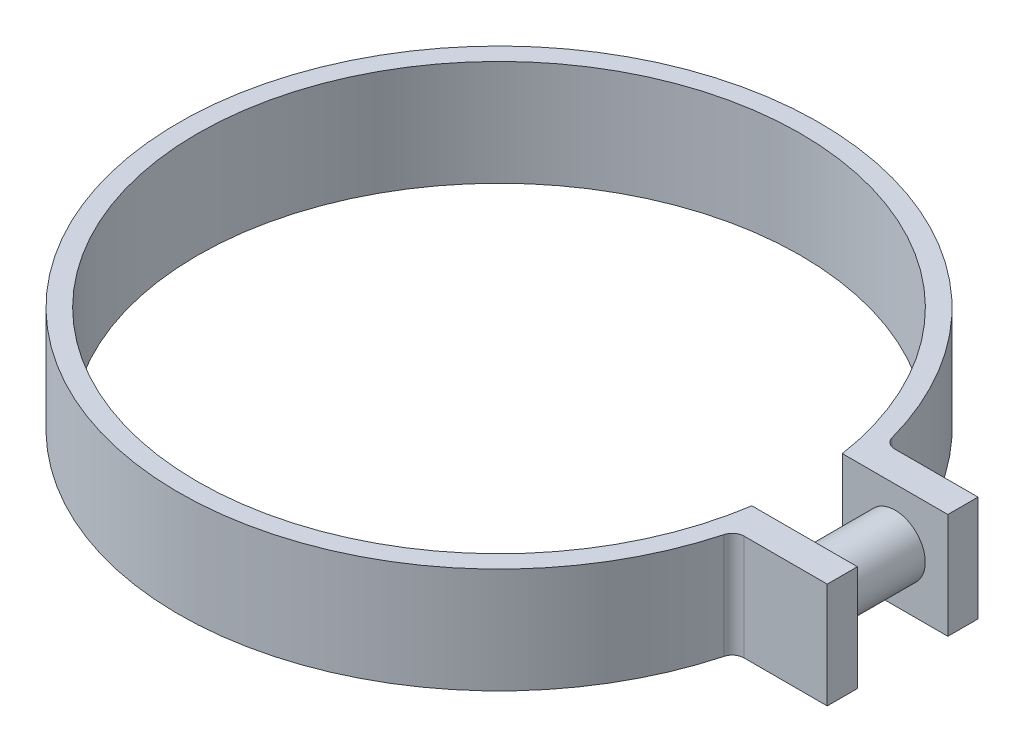
ISO-10303-21;
HEADER;
FILE_DESCRIPTION(('STEP AP214'),'2;1');
FILE_NAME('part.step','',(''),(''),'','','');
FILE_SCHEMA(('AUTOMOTIVE_DESIGN { 1 0 10303 214 1 1 1 1 }'));
ENDSEC;
DATA;
#1=APPLICATION_CONTEXT('core data for automotive mechanical design processes');
#2=APPLICATION_PROTOCOL_DEFINITION('international standard','automotive_design',2000,#1);
#3=PRODUCT_CONTEXT('',#1,'mechanical');
#4=PRODUCT('Part','Part','',(#3));
#5=PRODUCT_RELATED_PRODUCT_CATEGORY('part','',(#4));
#6=PRODUCT_DEFINITION_FORMATION('','',#4);
#7=PRODUCT_DEFINITION_CONTEXT('part definition',#1,'design');
#8=PRODUCT_DEFINITION('design','',#6,#7);
#9=PRODUCT_DEFINITION_SHAPE('','',#8);
#10=(LENGTH_UNIT() NAMED_UNIT(*) SI_UNIT(.MILLI.,.METRE.));
#11=(NAMED_UNIT(*) PLANE_ANGLE_UNIT() SI_UNIT($,.RADIAN.));
#12=(NAMED_UNIT(*) SI_UNIT($,.STERADIAN.) SOLID_ANGLE_UNIT());
#13=UNCERTAINTY_MEASURE_WITH_UNIT(LENGTH_MEASURE(1.E-05),#10,'distance_accuracy_value','');
#14=(GEOMETRIC_REPRESENTATION_CONTEXT(3) GLOBAL_UNCERTAINTY_ASSIGNED_CONTEXT((#13)) GLOBAL_UNIT_ASSIGNED_CONTEXT((#10,
#11,#12)) REPRESENTATION_CONTEXT('',''));
#15=CARTESIAN_POINT('',(0.,0.,0.));
#16=DIRECTION('',(0.,0.,1.));
#17=DIRECTION('',(1.,0.,0.));
#18=AXIS2_PLACEMENT_3D('',#15,#16,#17);
#19=CARTESIAN_POINT('',(34.0026243152722,4.445,-3.81));
#20=DIRECTION('',(-1.,0.,0.));
#21=DIRECTION('',(0.,0.,1.));
#22=AXIS2_PLACEMENT_3D('',#19,#20,#21);
#23=PLANE('',#22);
#24=DIRECTION('',(0.,0.,-1.));
#25=VECTOR('',#24,1.);
#26=CARTESIAN_POINT('',(34.0026243152722,-4.445,-3.81));
#27=LINE('',#26,#25);
#28=CARTESIAN_POINT('',(34.0026243152722,-4.445,-3.81));
#29=VERTEX_POINT('',#28);
#30=CARTESIAN_POINT('',(34.0026243152722,-4.445,-6.35));
#31=VERTEX_POINT('',#30);
#32=EDGE_CURVE('E159',#29,#31,#27,.T.);
#33=ORIENTED_EDGE('',*,*,#32,.T.);
#34=DIRECTION('',(0.,-1.,0.));
#35=VECTOR('',#34,1.);
#36=CARTESIAN_POINT('',(34.0026243152722,4.445,-6.35));
#37=LINE('',#36,#35);
#38=CARTESIAN_POINT('',(34.0026243152722,4.445,-6.35));
#39=VERTEX_POINT('',#38);
#40=EDGE_CURVE('E214',#39,#31,#37,.T.);
#41=ORIENTED_EDGE('',*,*,#40,.F.);
#42=DIRECTION('',(0.,0.,-1.));
#43=VECTOR('',#42,1.);
#44=CARTESIAN_POINT('',(34.0026243152722,4.445,-3.81));
#45=LINE('',#44,#43);
#46=CARTESIAN_POINT('',(34.0026243152722,4.445,-3.81));
#47=VERTEX_POINT('',#46);
#48=EDGE_CURVE('E187',#47,#39,#45,.T.);
#49=ORIENTED_EDGE('',*,*,#48,.F.);
#50=DIRECTION('',(0.,-1.,0.));
#51=VECTOR('',#50,1.);
#52=CARTESIAN_POINT('',(34.0026243152722,4.445,-3.81));
#53=LINE('',#52,#51);
#54=EDGE_CURVE('E155',#47,#29,#53,.T.);
#55=ORIENTED_EDGE('',*,*,#54,.T.);
#56=EDGE_LOOP('',(#33,#41,#49,#55));
#57=FACE_BOUND('',#56,.T.);
#58=ADVANCED_FACE('F45',(#57),#23,.F.);
#59=CARTESIAN_POINT('',(34.0026243152722,4.445,-6.35));
#60=DIRECTION('',(0.,0.,1.));
#61=DIRECTION('',(1.,0.,0.));
#62=AXIS2_PLACEMENT_3D('',#59,#60,#61);
#63=PLANE('',#62);
#64=DIRECTION('',(-1.,0.,0.));
#65=VECTOR('',#64,1.);
#66=CARTESIAN_POINT('',(34.0026243152722,-4.445,-6.35));
#67=LINE('',#66,#65);
#68=CARTESIAN_POINT('',(26.9875,-4.445,-6.35));
#69=VERTEX_POINT('',#68);
#70=EDGE_CURVE('E163',#31,#69,#67,.T.);
#71=ORIENTED_EDGE('',*,*,#70,.T.);
#72=DIRECTION('',(0.,-1.,0.));
#73=VECTOR('',#72,1.);
#74=CARTESIAN_POINT('',(26.9875,4.445,-6.35));
#75=LINE('',#74,#73);
#76=CARTESIAN_POINT('',(26.9875,4.445,-6.35));
#77=VERTEX_POINT('',#76);
#78=EDGE_CURVE('E210',#77,#69,#75,.T.);
#79=ORIENTED_EDGE('',*,*,#78,.F.);
#80=DIRECTION('',(-1.,0.,0.));
#81=VECTOR('',#80,1.);
#82=CARTESIAN_POINT('',(34.0026243152722,4.445,-6.35));
#83=LINE('',#82,#81);
#84=EDGE_CURVE('E112',#39,#77,#83,.T.);
#85=ORIENTED_EDGE('',*,*,#84,.F.);
#86=ORIENTED_EDGE('',*,*,#40,.T.);
#87=EDGE_LOOP('',(#71,#79,#85,#86));
#88=FACE_BOUND('',#87,.T.);
#89=ADVANCED_FACE('F237',(#88),#63,.F.);
#90=CARTESIAN_POINT('',(26.9875,4.445,-7.32692307692307));
#91=DIRECTION('',(0.,-1.,0.));
#92=DIRECTION('',(0.,0.,-1.));
#93=AXIS2_PLACEMENT_3D('',#90,#91,#92);
#94=CYLINDRICAL_SURFACE('',#93,0.976923076923077);
#95=CARTESIAN_POINT('',(26.9875,-4.445,-7.32692307692307));
#96=DIRECTION('',(0.,-1.,0.));
#97=DIRECTION('',(0.,0.,-1.));
#98=AXIS2_PLACEMENT_3D('',#95,#96,#97);
#99=CIRCLE('',#98,0.976923076923077);
#100=CARTESIAN_POINT('',(26.0447052401747,-4.445,-7.07096069868996));
#101=VERTEX_POINT('',#100);
#102=EDGE_CURVE('E166',#69,#101,#99,.T.);
#103=ORIENTED_EDGE('',*,*,#102,.T.);
#104=DIRECTION('',(0.,-1.,0.));
#105=VECTOR('',#104,1.);
#106=CARTESIAN_POINT('',(26.0447052401747,4.445,-7.07096069868996));
#107=LINE('',#106,#105);
#108=CARTESIAN_POINT('',(26.0447052401747,4.445,-7.07096069868996));
#109=VERTEX_POINT('',#108);
#110=EDGE_CURVE('E206',#109,#101,#107,.T.);
#111=ORIENTED_EDGE('',*,*,#110,.F.);
#112=CARTESIAN_POINT('',(26.9875,4.445,-7.32692307692307));
#113=DIRECTION('',(0.,-1.,0.));
#114=DIRECTION('',(0.,0.,-1.));
#115=AXIS2_PLACEMENT_3D('',#112,#113,#114);
#116=CIRCLE('',#115,0.976923076923077);
#117=EDGE_CURVE('E252',#77,#109,#116,.T.);
#118=ORIENTED_EDGE('',*,*,#117,.F.);
#119=ORIENTED_EDGE('',*,*,#78,.T.);
#120=EDGE_LOOP('',(#103,#111,#118,#119));
#121=FACE_BOUND('',#120,.T.);
#122=ADVANCED_FACE('F242',(#121),#94,.F.);
#123=CARTESIAN_POINT('',(0.,4.445,0.));
#124=DIRECTION('',(0.,-1.,0.));
#125=DIRECTION('',(0.,0.,-1.));
#126=AXIS2_PLACEMENT_3D('',#123,#124,#125);
#127=CYLINDRICAL_SURFACE('',#126,26.9875);
#128=CARTESIAN_POINT('',(0.,-4.445,0.));
#129=DIRECTION('',(0.,1.,0.));
#130=DIRECTION('',(0.,0.,1.));
#131=AXIS2_PLACEMENT_3D('',#128,#129,#130);
#132=CIRCLE('',#131,26.9875);
#133=CARTESIAN_POINT('',(26.0447052401747,-4.445,7.07096069868995));
#134=VERTEX_POINT('',#133);
#135=EDGE_CURVE('E169',#101,#134,#132,.T.);
#136=ORIENTED_EDGE('',*,*,#135,.T.);
#137=DIRECTION('',(0.,-1.,0.));
#138=VECTOR('',#137,1.);
#139=CARTESIAN_POINT('',(26.0447052401747,4.445,7.07096069868995));
#140=LINE('',#139,#138);
#141=CARTESIAN_POINT('',(26.0447052401747,4.445,7.07096069868995));
#142=VERTEX_POINT('',#141);
#143=EDGE_CURVE('E202',#142,#134,#140,.T.);
#144=ORIENTED_EDGE('',*,*,#143,.F.);
#145=CARTESIAN_POINT('',(0.,4.445,0.));
#146=DIRECTION('',(0.,1.,0.));
#147=DIRECTION('',(0.,0.,1.));
#148=AXIS2_PLACEMENT_3D('',#145,#146,#147);
#149=CIRCLE('',#148,26.9875);
#150=EDGE_CURVE('E255',#109,#142,#149,.T.);
#151=ORIENTED_EDGE('',*,*,#150,.F.);
#152=ORIENTED_EDGE('',*,*,#110,.T.);
#153=EDGE_LOOP('',(#136,#144,#151,#152));
#154=FACE_BOUND('',#153,.T.);
#155=ADVANCED_FACE('F284',(#154),#127,.T.);
#156=CARTESIAN_POINT('',(26.9875,4.445,7.32692307692307));
#157=DIRECTION('',(0.,-1.,0.));
#158=DIRECTION('',(0.,0.,-1.));
#159=AXIS2_PLACEMENT_3D('',#156,#157,#158);
#160=CYLINDRICAL_SURFACE('',#159,0.976923076923077);
#161=CARTESIAN_POINT('',(26.9875,-4.445,7.32692307692307));
#162=DIRECTION('',(0.,-1.,0.));
#163=DIRECTION('',(0.,0.,1.));
#164=AXIS2_PLACEMENT_3D('',#161,#162,#163);
#165=CIRCLE('',#164,0.976923076923077);
#166=CARTESIAN_POINT('',(26.9875,-4.445,6.35));
#167=VERTEX_POINT('',#166);
#168=EDGE_CURVE('E172',#134,#167,#165,.T.);
#169=ORIENTED_EDGE('',*,*,#168,.T.);
#170=DIRECTION('',(0.,-1.,0.));
#171=VECTOR('',#170,1.);
#172=CARTESIAN_POINT('',(26.9875,4.445,6.35));
#173=LINE('',#172,#171);
#174=CARTESIAN_POINT('',(26.9875,4.445,6.35));
#175=VERTEX_POINT('',#174);
#176=EDGE_CURVE('E198',#175,#167,#173,.T.);
#177=ORIENTED_EDGE('',*,*,#176,.F.);
#178=CARTESIAN_POINT('',(26.9875,4.445,7.32692307692307));
#179=DIRECTION('',(0.,-1.,0.));
#180=DIRECTION('',(0.,0.,1.));
#181=AXIS2_PLACEMENT_3D('',#178,#179,#180);
#182=CIRCLE('',#181,0.976923076923077);
#183=EDGE_CURVE('E259',#142,#175,#182,.T.);
#184=ORIENTED_EDGE('',*,*,#183,.F.);
#185=ORIENTED_EDGE('',*,*,#143,.T.);
#186=EDGE_LOOP('',(#169,#177,#184,#185));
#187=FACE_BOUND('',#186,.T.);
#188=ADVANCED_FACE('F281',(#187),#160,.F.);
#189=CARTESIAN_POINT('',(34.0026243152722,4.445,6.35));
#190=DIRECTION('',(0.,0.,-1.));
#191=DIRECTION('',(-1.,0.,0.));
#192=AXIS2_PLACEMENT_3D('',#189,#190,#191);
#193=PLANE('',#192);
#194=DIRECTION('',(1.,0.,0.));
#195=VECTOR('',#194,1.);
#196=CARTESIAN_POINT('',(34.0026243152722,-4.445,6.35));
#197=LINE('',#196,#195);
#198=CARTESIAN_POINT('',(34.0026243152722,-4.445,6.35));
#199=VERTEX_POINT('',#198);
#200=EDGE_CURVE('E175',#167,#199,#197,.T.);
#201=ORIENTED_EDGE('',*,*,#200,.T.);
#202=DIRECTION('',(0.,-1.,0.));
#203=VECTOR('',#202,1.);
#204=CARTESIAN_POINT('',(34.0026243152722,4.445,6.35));
#205=LINE('',#204,#203);
#206=CARTESIAN_POINT('',(34.0026243152722,4.445,6.35));
#207=VERTEX_POINT('',#206);
#208=EDGE_CURVE('E194',#207,#199,#205,.T.);
#209=ORIENTED_EDGE('',*,*,#208,.F.);
#210=DIRECTION('',(1.,0.,0.));
#211=VECTOR('',#210,1.);
#212=CARTESIAN_POINT('',(34.0026243152722,4.445,6.35));
#213=LINE('',#212,#211);
#214=EDGE_CURVE('E266',#175,#207,#213,.T.);
#215=ORIENTED_EDGE('',*,*,#214,.F.);
#216=ORIENTED_EDGE('',*,*,#176,.T.);
#217=EDGE_LOOP('',(#201,#209,#215,#216));
#218=FACE_BOUND('',#217,.T.);
#219=ADVANCED_FACE('F274',(#218),#193,.F.);
#220=CARTESIAN_POINT('',(34.0026243152722,4.445,3.81));
#221=DIRECTION('',(-1.,0.,0.));
#222=DIRECTION('',(0.,0.,1.));
#223=AXIS2_PLACEMENT_3D('',#220,#221,#222);
#224=PLANE('',#223);
#225=DIRECTION('',(0.,0.,-1.));
#226=VECTOR('',#225,1.);
#227=CARTESIAN_POINT('',(34.0026243152722,-4.445,3.81));
#228=LINE('',#227,#226);
#229=CARTESIAN_POINT('',(34.0026243152722,-4.445,3.81));
#230=VERTEX_POINT('',#229);
#231=EDGE_CURVE('E178',#199,#230,#228,.T.);
#232=ORIENTED_EDGE('',*,*,#231,.T.);
#233=DIRECTION('',(0.,-1.,0.));
#234=VECTOR('',#233,1.);
#235=CARTESIAN_POINT('',(34.0026243152722,4.445,3.81));
#236=LINE('',#235,#234);
#237=CARTESIAN_POINT('',(34.0026243152722,4.445,3.81));
#238=VERTEX_POINT('',#237);
#239=EDGE_CURVE('E148',#238,#230,#236,.T.);
#240=ORIENTED_EDGE('',*,*,#239,.F.);
#241=DIRECTION('',(0.,0.,-1.));
#242=VECTOR('',#241,1.);
#243=CARTESIAN_POINT('',(34.0026243152722,4.445,3.81));
#244=LINE('',#243,#242);
#245=EDGE_CURVE('E137',#207,#238,#244,.T.);
#246=ORIENTED_EDGE('',*,*,#245,.F.);
#247=ORIENTED_EDGE('',*,*,#208,.T.);
#248=EDGE_LOOP('',(#232,#240,#246,#247));
#249=FACE_BOUND('',#248,.T.);
#250=ADVANCED_FACE('F278',(#249),#224,.F.);
#251=CARTESIAN_POINT('',(34.0026243152722,4.445,3.81));
#252=DIRECTION('',(0.,0.,1.));
#253=DIRECTION('',(1.,0.,0.));
#254=AXIS2_PLACEMENT_3D('',#251,#252,#253);
#255=PLANE('',#254);
#256=CARTESIAN_POINT('',(29.5576243152722,0.,3.81));
#257=DIRECTION('',(0.,0.,1.));
#258=DIRECTION('',(1.,0.,0.));
#259=AXIS2_PLACEMENT_3D('',#256,#257,#258);
#260=CIRCLE('',#259,2.54);
#261=CARTESIAN_POINT('',(32.0976243152722,0.,3.81));
#262=VERTEX_POINT('',#261);
#263=EDGE_CURVE('E11',#262,#262,#260,.F.);
#264=ORIENTED_EDGE('',*,*,#263,.F.);
#265=EDGE_LOOP('',(#264));
#266=FACE_BOUND('',#265,.T.);
#267=DIRECTION('',(-1.,0.,0.));
#268=VECTOR('',#267,1.);
#269=CARTESIAN_POINT('',(34.0026243152722,-4.445,3.81));
#270=LINE('',#269,#268);
#271=CARTESIAN_POINT('',(25.1126243152722,-4.445,3.81000000000001));
#272=VERTEX_POINT('',#271);
#273=EDGE_CURVE('E146',#230,#272,#270,.T.);
#274=ORIENTED_EDGE('',*,*,#273,.T.);
#275=DIRECTION('',(0.,-1.,0.));
#276=VECTOR('',#275,1.);
#277=CARTESIAN_POINT('',(25.1126243152722,4.445,3.81000000000001));
#278=LINE('',#277,#276);
#279=CARTESIAN_POINT('',(25.1126243152722,4.445,3.81000000000001));
#280=VERTEX_POINT('',#279);
#281=EDGE_CURVE('E143',#280,#272,#278,.T.);
#282=ORIENTED_EDGE('',*,*,#281,.F.);
#283=DIRECTION('',(-1.,0.,0.));
#284=VECTOR('',#283,1.);
#285=CARTESIAN_POINT('',(34.0026243152722,4.445,3.81));
#286=LINE('',#285,#284);
#287=EDGE_CURVE('E131',#238,#280,#286,.T.);
#288=ORIENTED_EDGE('',*,*,#287,.F.);
#289=ORIENTED_EDGE('',*,*,#239,.T.);
#290=EDGE_LOOP('',(#274,#282,#288,#289));
#291=FACE_BOUND('',#290,.T.);
#292=ADVANCED_FACE('F144',(#266,#291),#255,.F.);
#293=CARTESIAN_POINT('',(0.,4.445,0.));
#294=DIRECTION('',(0.,-1.,0.));
#295=DIRECTION('',(0.,0.,-1.));
#296=AXIS2_PLACEMENT_3D('',#293,#294,#295);
#297=CYLINDRICAL_SURFACE('',#296,25.4);
#298=CARTESIAN_POINT('',(0.,-4.445,0.));
#299=DIRECTION('',(0.,-1.,0.));
#300=DIRECTION('',(0.,0.,1.));
#301=AXIS2_PLACEMENT_3D('',#298,#299,#300);
#302=CIRCLE('',#301,25.4);
#303=CARTESIAN_POINT('',(25.1126243152722,-4.445,-3.81));
#304=VERTEX_POINT('',#303);
#305=EDGE_CURVE('E97',#272,#304,#302,.T.);
#306=ORIENTED_EDGE('',*,*,#305,.T.);
#307=DIRECTION('',(0.,-1.,0.));
#308=VECTOR('',#307,1.);
#309=CARTESIAN_POINT('',(25.1126243152722,4.445,-3.81));
#310=LINE('',#309,#308);
#311=CARTESIAN_POINT('',(25.1126243152722,4.445,-3.81));
#312=VERTEX_POINT('',#311);
#313=EDGE_CURVE('E149',#312,#304,#310,.T.);
#314=ORIENTED_EDGE('',*,*,#313,.F.);
#315=CARTESIAN_POINT('',(0.,4.445,0.));
#316=DIRECTION('',(0.,-1.,0.));
#317=DIRECTION('',(0.,0.,1.));
#318=AXIS2_PLACEMENT_3D('',#315,#316,#317);
#319=CIRCLE('',#318,25.4);
#320=EDGE_CURVE('E135',#280,#312,#319,.T.);
#321=ORIENTED_EDGE('',*,*,#320,.F.);
#322=ORIENTED_EDGE('',*,*,#281,.T.);
#323=EDGE_LOOP('',(#306,#314,#321,#322));
#324=FACE_BOUND('',#323,.T.);
#325=ADVANCED_FACE('F151',(#324),#297,.F.);
#326=CARTESIAN_POINT('',(34.0026243152722,4.445,-3.81));
#327=DIRECTION('',(0.,0.,-1.));
#328=DIRECTION('',(-1.,0.,0.));
#329=AXIS2_PLACEMENT_3D('',#326,#327,#328);
#330=PLANE('',#329);
#331=CARTESIAN_POINT('',(29.5576243152722,0.,-3.81));
#332=DIRECTION('',(0.,0.,-1.));
#333=DIRECTION('',(-1.,0.,0.));
#334=AXIS2_PLACEMENT_3D('',#331,#332,#333);
#335=CIRCLE('',#334,2.54);
#336=CARTESIAN_POINT('',(27.0176243152722,0.,-3.81));
#337=VERTEX_POINT('',#336);
#338=EDGE_CURVE('E54',#337,#337,#335,.F.);
#339=ORIENTED_EDGE('',*,*,#338,.F.);
#340=EDGE_LOOP('',(#339));
#341=FACE_BOUND('',#340,.T.);
#342=DIRECTION('',(1.,0.,0.));
#343=VECTOR('',#342,1.);
#344=CARTESIAN_POINT('',(34.0026243152722,-4.445,-3.81));
#345=LINE('',#344,#343);
#346=EDGE_CURVE('E103',#304,#29,#345,.T.);
#347=ORIENTED_EDGE('',*,*,#346,.T.);
#348=ORIENTED_EDGE('',*,*,#54,.F.);
#349=DIRECTION('',(1.,0.,0.));
#350=VECTOR('',#349,1.);
#351=CARTESIAN_POINT('',(34.0026243152722,4.445,-3.81));
#352=LINE('',#351,#350);
#353=EDGE_CURVE('E62',#312,#47,#352,.T.);
#354=ORIENTED_EDGE('',*,*,#353,.F.);
#355=ORIENTED_EDGE('',*,*,#313,.T.);
#356=EDGE_LOOP('',(#347,#348,#354,#355));
#357=FACE_BOUND('',#356,.T.);
#358=ADVANCED_FACE('F223',(#341,#357),#330,.F.);
#359=CARTESIAN_POINT('',(26.9875,4.445,-7.32692307692307));
#360=DIRECTION('',(0.,-1.,0.));
#361=DIRECTION('',(0.,0.,-1.));
#362=AXIS2_PLACEMENT_3D('',#359,#360,#361);
#363=PLANE('',#362);
#364=ORIENTED_EDGE('',*,*,#48,.T.);
#365=ORIENTED_EDGE('',*,*,#84,.T.);
#366=ORIENTED_EDGE('',*,*,#117,.T.);
#367=ORIENTED_EDGE('',*,*,#150,.T.);
#368=ORIENTED_EDGE('',*,*,#183,.T.);
#369=ORIENTED_EDGE('',*,*,#214,.T.);
#370=ORIENTED_EDGE('',*,*,#245,.T.);
#371=ORIENTED_EDGE('',*,*,#287,.T.);
#372=ORIENTED_EDGE('',*,*,#320,.T.);
#373=ORIENTED_EDGE('',*,*,#353,.T.);
#374=EDGE_LOOP('',(#364,#365,#366,#367,#368,#369,#370,#371,#372,#373));
#375=FACE_BOUND('',#374,.T.);
#376=ADVANCED_FACE('F133',(#375),#363,.F.);
#377=CARTESIAN_POINT('',(26.9875,-4.445,-7.32692307692307));
#378=DIRECTION('',(0.,-1.,0.));
#379=DIRECTION('',(0.,0.,-1.));
#380=AXIS2_PLACEMENT_3D('',#377,#378,#379);
#381=PLANE('',#380);
#382=ORIENTED_EDGE('',*,*,#32,.F.);
#383=ORIENTED_EDGE('',*,*,#346,.F.);
#384=ORIENTED_EDGE('',*,*,#305,.F.);
#385=ORIENTED_EDGE('',*,*,#273,.F.);
#386=ORIENTED_EDGE('',*,*,#231,.F.);
#387=ORIENTED_EDGE('',*,*,#200,.F.);
#388=ORIENTED_EDGE('',*,*,#168,.F.);
#389=ORIENTED_EDGE('',*,*,#135,.F.);
#390=ORIENTED_EDGE('',*,*,#102,.F.);
#391=ORIENTED_EDGE('',*,*,#70,.F.);
#392=EDGE_LOOP('',(#382,#383,#384,#385,#386,#387,#388,#389,#390,#391));
#393=FACE_BOUND('',#392,.T.);
#394=ADVANCED_FACE('F231',(#393),#381,.T.);
#395=CARTESIAN_POINT('',(29.5576243152722,0.,26.9895));
#396=DIRECTION('',(0.,0.,-1.));
#397=DIRECTION('',(-1.,0.,0.));
#398=AXIS2_PLACEMENT_3D('',#395,#396,#397);
#399=CYLINDRICAL_SURFACE('',#398,2.54);
#400=ORIENTED_EDGE('',*,*,#338,.T.);
#401=EDGE_LOOP('',(#400));
#402=FACE_BOUND('',#401,.T.);
#403=ORIENTED_EDGE('',*,*,#263,.T.);
#404=EDGE_LOOP('',(#403));
#405=FACE_BOUND('',#404,.T.);
#406=ADVANCED_FACE('F220',(#402,#405),#399,.T.);
#407=CLOSED_SHELL('',(#58,#89,#122,#155,#188,#219,#250,#292,#325,#358,#376,#394,#406));
#408=MANIFOLD_SOLID_BREP('B2',#407);
#409=ADVANCED_BREP_SHAPE_REPRESENTATION('',(#18,#408),#14);
#410=SHAPE_DEFINITION_REPRESENTATION(#9,#409);
ENDSEC;
END-ISO-10303-21;
